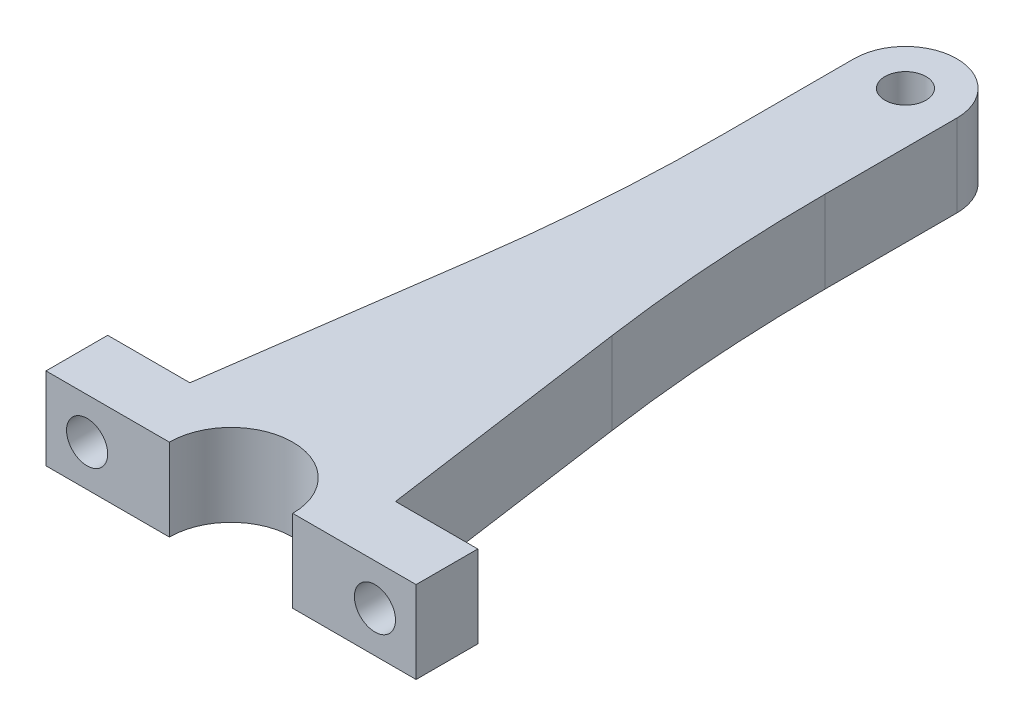
ISO-10303-21;
HEADER;
FILE_DESCRIPTION(('STEP AP214'),'2;1');
FILE_NAME('part.step','',(''),(''),'','','');
FILE_SCHEMA(('AUTOMOTIVE_DESIGN { 1 0 10303 214 1 1 1 1 }'));
ENDSEC;
DATA;
#1=APPLICATION_CONTEXT('core data for automotive mechanical design processes');
#2=APPLICATION_PROTOCOL_DEFINITION('international standard','automotive_design',2000,#1);
#3=PRODUCT_CONTEXT('',#1,'mechanical');
#4=PRODUCT('Part','Part','',(#3));
#5=PRODUCT_RELATED_PRODUCT_CATEGORY('part','',(#4));
#6=PRODUCT_DEFINITION_FORMATION('','',#4);
#7=PRODUCT_DEFINITION_CONTEXT('part definition',#1,'design');
#8=PRODUCT_DEFINITION('design','',#6,#7);
#9=PRODUCT_DEFINITION_SHAPE('','',#8);
#10=(LENGTH_UNIT() NAMED_UNIT(*) SI_UNIT(.MILLI.,.METRE.));
#11=(NAMED_UNIT(*) PLANE_ANGLE_UNIT() SI_UNIT($,.RADIAN.));
#12=(NAMED_UNIT(*) SI_UNIT($,.STERADIAN.) SOLID_ANGLE_UNIT());
#13=UNCERTAINTY_MEASURE_WITH_UNIT(LENGTH_MEASURE(1.E-05),#10,'distance_accuracy_value','');
#14=(GEOMETRIC_REPRESENTATION_CONTEXT(3) GLOBAL_UNCERTAINTY_ASSIGNED_CONTEXT((#13)) GLOBAL_UNIT_ASSIGNED_CONTEXT((#10,
#11,#12)) REPRESENTATION_CONTEXT('',''));
#15=CARTESIAN_POINT('',(0.,0.,0.));
#16=DIRECTION('',(0.,0.,1.));
#17=DIRECTION('',(1.,0.,0.));
#18=AXIS2_PLACEMENT_3D('',#15,#16,#17);
#19=CARTESIAN_POINT('',(0.,20.,-156.5));
#20=DIRECTION('',(0.,-1.,0.));
#21=DIRECTION('',(0.,0.,-1.));
#22=AXIS2_PLACEMENT_3D('',#19,#20,#21);
#23=CYLINDRICAL_SURFACE('',#22,12.5);
#24=CARTESIAN_POINT('',(0.,0.,-156.5));
#25=DIRECTION('',(0.,1.,0.));
#26=DIRECTION('',(0.,0.,1.));
#27=AXIS2_PLACEMENT_3D('',#24,#25,#26);
#28=CIRCLE('',#27,12.5);
#29=CARTESIAN_POINT('',(12.5,0.,-156.5));
#30=VERTEX_POINT('',#29);
#31=CARTESIAN_POINT('',(-12.5,0.,-156.5));
#32=VERTEX_POINT('',#31);
#33=EDGE_CURVE('E173',#30,#32,#28,.T.);
#34=ORIENTED_EDGE('',*,*,#33,.T.);
#35=DIRECTION('',(0.,-1.,0.));
#36=VECTOR('',#35,1.);
#37=CARTESIAN_POINT('',(-12.5,20.,-156.5));
#38=LINE('',#37,#36);
#39=CARTESIAN_POINT('',(-12.5,20.,-156.5));
#40=VERTEX_POINT('',#39);
#41=EDGE_CURVE('E151',#40,#32,#38,.T.);
#42=ORIENTED_EDGE('',*,*,#41,.F.);
#43=CARTESIAN_POINT('',(0.,20.,-156.5));
#44=DIRECTION('',(0.,1.,0.));
#45=DIRECTION('',(0.,0.,1.));
#46=AXIS2_PLACEMENT_3D('',#43,#44,#45);
#47=CIRCLE('',#46,12.5);
#48=CARTESIAN_POINT('',(12.5,20.,-156.5));
#49=VERTEX_POINT('',#48);
#50=EDGE_CURVE('E159',#49,#40,#47,.T.);
#51=ORIENTED_EDGE('',*,*,#50,.F.);
#52=DIRECTION('',(0.,-1.,0.));
#53=VECTOR('',#52,1.);
#54=CARTESIAN_POINT('',(12.5,20.,-156.5));
#55=LINE('',#54,#53);
#56=EDGE_CURVE('E263',#49,#30,#55,.T.);
#57=ORIENTED_EDGE('',*,*,#56,.T.);
#58=EDGE_LOOP('',(#34,#42,#51,#57));
#59=FACE_BOUND('',#58,.T.);
#60=ADVANCED_FACE('F44',(#59),#23,.T.);
#61=CARTESIAN_POINT('',(-12.5,20.,0.));
#62=DIRECTION('',(-1.,0.,0.));
#63=DIRECTION('',(0.,0.,1.));
#64=AXIS2_PLACEMENT_3D('',#61,#62,#63);
#65=PLANE('',#64);
#66=DIRECTION('',(0.,0.,-1.));
#67=VECTOR('',#66,1.);
#68=CARTESIAN_POINT('',(-12.5,0.,0.));
#69=LINE('',#68,#67);
#70=CARTESIAN_POINT('',(-12.5,0.,-124.412846307206));
#71=VERTEX_POINT('',#70);
#72=EDGE_CURVE('E216',#71,#32,#69,.T.);
#73=ORIENTED_EDGE('',*,*,#72,.F.);
#74=DIRECTION('',(0.,-1.,0.));
#75=VECTOR('',#74,1.);
#76=CARTESIAN_POINT('',(-12.5,20.,-124.412846307206));
#77=LINE('',#76,#75);
#78=CARTESIAN_POINT('',(-12.5,20.,-124.412846307206));
#79=VERTEX_POINT('',#78);
#80=EDGE_CURVE('E154',#71,#79,#77,.F.);
#81=ORIENTED_EDGE('',*,*,#80,.T.);
#82=DIRECTION('',(0.,0.,-1.));
#83=VECTOR('',#82,1.);
#84=CARTESIAN_POINT('',(-12.5,20.,0.));
#85=LINE('',#84,#83);
#86=EDGE_CURVE('E146',#79,#40,#85,.T.);
#87=ORIENTED_EDGE('',*,*,#86,.T.);
#88=ORIENTED_EDGE('',*,*,#41,.T.);
#89=EDGE_LOOP('',(#73,#81,#87,#88));
#90=FACE_BOUND('',#89,.T.);
#91=ADVANCED_FACE('F149',(#90),#65,.T.);
#92=CARTESIAN_POINT('',(-25.5494112835427,20.,-3.5907355879438));
#93=DIRECTION('',(-0.99026806874157,0.,-0.139173100960066));
#94=DIRECTION('',(-0.139173100960066,0.,0.99026806874157));
#95=AXIS2_PLACEMENT_3D('',#92,#93,#94);
#96=PLANE('',#95);
#97=DIRECTION('',(0.139173100960066,0.,-0.99026806874157));
#98=VECTOR('',#97,1.);
#99=CARTESIAN_POINT('',(-25.5494112835427,20.,-3.5907355879438));
#100=LINE('',#99,#98);
#101=CARTESIAN_POINT('',(-25.,20.,-7.5));
#102=VERTEX_POINT('',#101);
#103=CARTESIAN_POINT('',(-16.3927725033719,20.,-68.7436059231801));
#104=VERTEX_POINT('',#103);
#105=EDGE_CURVE('E158',#102,#104,#100,.T.);
#106=ORIENTED_EDGE('',*,*,#105,.T.);
#107=DIRECTION('',(0.,-1.,0.));
#108=VECTOR('',#107,1.);
#109=CARTESIAN_POINT('',(-16.3927725033719,0.,-68.7436059231801));
#110=LINE('',#109,#108);
#111=CARTESIAN_POINT('',(-16.3927725033719,0.,-68.7436059231801));
#112=VERTEX_POINT('',#111);
#113=EDGE_CURVE('E175',#104,#112,#110,.T.);
#114=ORIENTED_EDGE('',*,*,#113,.T.);
#115=DIRECTION('',(0.139173100960066,0.,-0.99026806874157));
#116=VECTOR('',#115,1.);
#117=CARTESIAN_POINT('',(-25.5494112835427,0.,-3.5907355879438));
#118=LINE('',#117,#116);
#119=CARTESIAN_POINT('',(-25.,0.,-7.5));
#120=VERTEX_POINT('',#119);
#121=EDGE_CURVE('E218',#120,#112,#118,.T.);
#122=ORIENTED_EDGE('',*,*,#121,.F.);
#123=DIRECTION('',(0.,-1.,0.));
#124=VECTOR('',#123,1.);
#125=CARTESIAN_POINT('',(-25.,20.,-7.5));
#126=LINE('',#125,#124);
#127=EDGE_CURVE('E176',#102,#120,#126,.T.);
#128=ORIENTED_EDGE('',*,*,#127,.F.);
#129=EDGE_LOOP('',(#106,#114,#122,#128));
#130=FACE_BOUND('',#129,.T.);
#131=ADVANCED_FACE('F207',(#130),#96,.T.);
#132=CARTESIAN_POINT('',(0.,20.,-7.5));
#133=DIRECTION('',(0.,0.,-1.));
#134=DIRECTION('',(-1.,0.,0.));
#135=AXIS2_PLACEMENT_3D('',#132,#133,#134);
#136=PLANE('',#135);
#137=CARTESIAN_POINT('',(-35.,10.,-7.5));
#138=DIRECTION('',(0.,0.,-1.));
#139=DIRECTION('',(-1.,0.,0.));
#140=AXIS2_PLACEMENT_3D('',#137,#138,#139);
#141=CIRCLE('',#140,5.);
#142=CARTESIAN_POINT('',(-40.,10.,-7.5));
#143=VERTEX_POINT('',#142);
#144=EDGE_CURVE('E371',#143,#143,#141,.T.);
#145=ORIENTED_EDGE('',*,*,#144,.F.);
#146=EDGE_LOOP('',(#145));
#147=FACE_BOUND('',#146,.T.);
#148=DIRECTION('',(1.,0.,0.));
#149=VECTOR('',#148,1.);
#150=CARTESIAN_POINT('',(0.,0.,-7.5));
#151=LINE('',#150,#149);
#152=CARTESIAN_POINT('',(-45.,0.,-7.5));
#153=VERTEX_POINT('',#152);
#154=EDGE_CURVE('E223',#153,#120,#151,.T.);
#155=ORIENTED_EDGE('',*,*,#154,.F.);
#156=DIRECTION('',(0.,-1.,0.));
#157=VECTOR('',#156,1.);
#158=CARTESIAN_POINT('',(-45.,20.,-7.5));
#159=LINE('',#158,#157);
#160=CARTESIAN_POINT('',(-45.,20.,-7.5));
#161=VERTEX_POINT('',#160);
#162=EDGE_CURVE('E182',#161,#153,#159,.T.);
#163=ORIENTED_EDGE('',*,*,#162,.F.);
#164=DIRECTION('',(1.,0.,0.));
#165=VECTOR('',#164,1.);
#166=CARTESIAN_POINT('',(0.,20.,-7.5));
#167=LINE('',#166,#165);
#168=EDGE_CURVE('E211',#161,#102,#167,.T.);
#169=ORIENTED_EDGE('',*,*,#168,.T.);
#170=ORIENTED_EDGE('',*,*,#127,.T.);
#171=EDGE_LOOP('',(#155,#163,#169,#170));
#172=FACE_BOUND('',#171,.T.);
#173=ADVANCED_FACE('F294',(#147,#172),#136,.T.);
#174=CARTESIAN_POINT('',(-45.,20.,0.));
#175=DIRECTION('',(-1.,0.,0.));
#176=DIRECTION('',(0.,0.,1.));
#177=AXIS2_PLACEMENT_3D('',#174,#175,#176);
#178=PLANE('',#177);
#179=DIRECTION('',(0.,0.,-1.));
#180=VECTOR('',#179,1.);
#181=CARTESIAN_POINT('',(-45.,0.,0.));
#182=LINE('',#181,#180);
#183=CARTESIAN_POINT('',(-45.,0.,7.5));
#184=VERTEX_POINT('',#183);
#185=EDGE_CURVE('E231',#184,#153,#182,.T.);
#186=ORIENTED_EDGE('',*,*,#185,.F.);
#187=DIRECTION('',(0.,-1.,0.));
#188=VECTOR('',#187,1.);
#189=CARTESIAN_POINT('',(-45.,20.,7.5));
#190=LINE('',#189,#188);
#191=CARTESIAN_POINT('',(-45.,20.,7.5));
#192=VERTEX_POINT('',#191);
#193=EDGE_CURVE('E283',#192,#184,#190,.T.);
#194=ORIENTED_EDGE('',*,*,#193,.F.);
#195=DIRECTION('',(0.,0.,-1.));
#196=VECTOR('',#195,1.);
#197=CARTESIAN_POINT('',(-45.,20.,0.));
#198=LINE('',#197,#196);
#199=EDGE_CURVE('E292',#192,#161,#198,.T.);
#200=ORIENTED_EDGE('',*,*,#199,.T.);
#201=ORIENTED_EDGE('',*,*,#162,.T.);
#202=EDGE_LOOP('',(#186,#194,#200,#201));
#203=FACE_BOUND('',#202,.T.);
#204=ADVANCED_FACE('F290',(#203),#178,.T.);
#205=CARTESIAN_POINT('',(0.,20.,7.5));
#206=DIRECTION('',(0.,0.,-1.));
#207=DIRECTION('',(-1.,0.,0.));
#208=AXIS2_PLACEMENT_3D('',#205,#206,#207);
#209=PLANE('',#208);
#210=CARTESIAN_POINT('',(-35.,10.,7.5));
#211=DIRECTION('',(0.,0.,-1.));
#212=DIRECTION('',(-1.,0.,0.));
#213=AXIS2_PLACEMENT_3D('',#210,#211,#212);
#214=CIRCLE('',#213,5.);
#215=CARTESIAN_POINT('',(-40.,10.,7.5));
#216=VERTEX_POINT('',#215);
#217=EDGE_CURVE('E225',#216,#216,#214,.T.);
#218=ORIENTED_EDGE('',*,*,#217,.T.);
#219=EDGE_LOOP('',(#218));
#220=FACE_BOUND('',#219,.T.);
#221=DIRECTION('',(1.,0.,0.));
#222=VECTOR('',#221,1.);
#223=CARTESIAN_POINT('',(0.,0.,7.5));
#224=LINE('',#223,#222);
#225=CARTESIAN_POINT('',(-15.,0.,7.5));
#226=VERTEX_POINT('',#225);
#227=EDGE_CURVE('E235',#184,#226,#224,.T.);
#228=ORIENTED_EDGE('',*,*,#227,.T.);
#229=DIRECTION('',(0.,-1.,0.));
#230=VECTOR('',#229,1.);
#231=CARTESIAN_POINT('',(-15.,20.,7.5));
#232=LINE('',#231,#230);
#233=CARTESIAN_POINT('',(-15.,20.,7.5));
#234=VERTEX_POINT('',#233);
#235=EDGE_CURVE('E280',#234,#226,#232,.T.);
#236=ORIENTED_EDGE('',*,*,#235,.F.);
#237=DIRECTION('',(1.,0.,0.));
#238=VECTOR('',#237,1.);
#239=CARTESIAN_POINT('',(0.,20.,7.5));
#240=LINE('',#239,#238);
#241=EDGE_CURVE('E303',#192,#234,#240,.T.);
#242=ORIENTED_EDGE('',*,*,#241,.F.);
#243=ORIENTED_EDGE('',*,*,#193,.T.);
#244=EDGE_LOOP('',(#228,#236,#242,#243));
#245=FACE_BOUND('',#244,.T.);
#246=ADVANCED_FACE('F300',(#220,#245),#209,.F.);
#247=CARTESIAN_POINT('',(0.,20.,7.5));
#248=DIRECTION('',(0.,-1.,0.));
#249=DIRECTION('',(0.,0.,-1.));
#250=AXIS2_PLACEMENT_3D('',#247,#248,#249);
#251=CYLINDRICAL_SURFACE('',#250,15.);
#252=CARTESIAN_POINT('',(0.,0.,7.5));
#253=DIRECTION('',(0.,1.,0.));
#254=DIRECTION('',(0.,0.,1.));
#255=AXIS2_PLACEMENT_3D('',#252,#253,#254);
#256=CIRCLE('',#255,15.);
#257=CARTESIAN_POINT('',(15.,0.,7.5));
#258=VERTEX_POINT('',#257);
#259=EDGE_CURVE('E239',#258,#226,#256,.T.);
#260=ORIENTED_EDGE('',*,*,#259,.F.);
#261=DIRECTION('',(0.,-1.,0.));
#262=VECTOR('',#261,1.);
#263=CARTESIAN_POINT('',(15.,20.,7.5));
#264=LINE('',#263,#262);
#265=CARTESIAN_POINT('',(15.,20.,7.5));
#266=VERTEX_POINT('',#265);
#267=EDGE_CURVE('E277',#266,#258,#264,.T.);
#268=ORIENTED_EDGE('',*,*,#267,.F.);
#269=CARTESIAN_POINT('',(0.,20.,7.5));
#270=DIRECTION('',(0.,1.,0.));
#271=DIRECTION('',(0.,0.,1.));
#272=AXIS2_PLACEMENT_3D('',#269,#270,#271);
#273=CIRCLE('',#272,15.);
#274=EDGE_CURVE('E306',#266,#234,#273,.T.);
#275=ORIENTED_EDGE('',*,*,#274,.T.);
#276=ORIENTED_EDGE('',*,*,#235,.T.);
#277=EDGE_LOOP('',(#260,#268,#275,#276));
#278=FACE_BOUND('',#277,.T.);
#279=ADVANCED_FACE('F417',(#278),#251,.F.);
#280=CARTESIAN_POINT('',(0.,20.,7.5));
#281=DIRECTION('',(0.,0.,-1.));
#282=DIRECTION('',(-1.,0.,0.));
#283=AXIS2_PLACEMENT_3D('',#280,#281,#282);
#284=PLANE('',#283);
#285=CARTESIAN_POINT('',(35.,9.99999999999999,7.5));
#286=DIRECTION('',(0.,0.,-1.));
#287=DIRECTION('',(1.,0.,0.));
#288=AXIS2_PLACEMENT_3D('',#285,#286,#287);
#289=CIRCLE('',#288,5.);
#290=CARTESIAN_POINT('',(40.,9.99999999999999,7.5));
#291=VERTEX_POINT('',#290);
#292=EDGE_CURVE('E380',#291,#291,#289,.T.);
#293=ORIENTED_EDGE('',*,*,#292,.T.);
#294=EDGE_LOOP('',(#293));
#295=FACE_BOUND('',#294,.T.);
#296=DIRECTION('',(1.,0.,0.));
#297=VECTOR('',#296,1.);
#298=CARTESIAN_POINT('',(0.,0.,7.5));
#299=LINE('',#298,#297);
#300=CARTESIAN_POINT('',(45.,0.,7.5));
#301=VERTEX_POINT('',#300);
#302=EDGE_CURVE('E243',#258,#301,#299,.T.);
#303=ORIENTED_EDGE('',*,*,#302,.T.);
#304=DIRECTION('',(0.,-1.,0.));
#305=VECTOR('',#304,1.);
#306=CARTESIAN_POINT('',(45.,20.,7.5));
#307=LINE('',#306,#305);
#308=CARTESIAN_POINT('',(45.,20.,7.5));
#309=VERTEX_POINT('',#308);
#310=EDGE_CURVE('E273',#309,#301,#307,.T.);
#311=ORIENTED_EDGE('',*,*,#310,.F.);
#312=DIRECTION('',(1.,0.,0.));
#313=VECTOR('',#312,1.);
#314=CARTESIAN_POINT('',(0.,20.,7.5));
#315=LINE('',#314,#313);
#316=EDGE_CURVE('E315',#266,#309,#315,.T.);
#317=ORIENTED_EDGE('',*,*,#316,.F.);
#318=ORIENTED_EDGE('',*,*,#267,.T.);
#319=EDGE_LOOP('',(#303,#311,#317,#318));
#320=FACE_BOUND('',#319,.T.);
#321=ADVANCED_FACE('F387',(#295,#320),#284,.F.);
#322=CARTESIAN_POINT('',(45.,20.,0.));
#323=DIRECTION('',(-1.,0.,0.));
#324=DIRECTION('',(0.,0.,1.));
#325=AXIS2_PLACEMENT_3D('',#322,#323,#324);
#326=PLANE('',#325);
#327=DIRECTION('',(0.,0.,-1.));
#328=VECTOR('',#327,1.);
#329=CARTESIAN_POINT('',(45.,0.,0.));
#330=LINE('',#329,#328);
#331=CARTESIAN_POINT('',(45.,0.,-7.5));
#332=VERTEX_POINT('',#331);
#333=EDGE_CURVE('E246',#301,#332,#330,.T.);
#334=ORIENTED_EDGE('',*,*,#333,.T.);
#335=DIRECTION('',(0.,-1.,0.));
#336=VECTOR('',#335,1.);
#337=CARTESIAN_POINT('',(45.,20.,-7.5));
#338=LINE('',#337,#336);
#339=CARTESIAN_POINT('',(45.,20.,-7.5));
#340=VERTEX_POINT('',#339);
#341=EDGE_CURVE('E270',#340,#332,#338,.T.);
#342=ORIENTED_EDGE('',*,*,#341,.F.);
#343=DIRECTION('',(0.,0.,-1.));
#344=VECTOR('',#343,1.);
#345=CARTESIAN_POINT('',(45.,20.,0.));
#346=LINE('',#345,#344);
#347=EDGE_CURVE('E318',#309,#340,#346,.T.);
#348=ORIENTED_EDGE('',*,*,#347,.F.);
#349=ORIENTED_EDGE('',*,*,#310,.T.);
#350=EDGE_LOOP('',(#334,#342,#348,#349));
#351=FACE_BOUND('',#350,.T.);
#352=ADVANCED_FACE('F396',(#351),#326,.F.);
#353=CARTESIAN_POINT('',(0.,20.,-7.5));
#354=DIRECTION('',(0.,0.,-1.));
#355=DIRECTION('',(-1.,0.,0.));
#356=AXIS2_PLACEMENT_3D('',#353,#354,#355);
#357=PLANE('',#356);
#358=CARTESIAN_POINT('',(35.,9.99999999999999,-7.5));
#359=DIRECTION('',(0.,0.,-1.));
#360=DIRECTION('',(1.,0.,0.));
#361=AXIS2_PLACEMENT_3D('',#358,#359,#360);
#362=CIRCLE('',#361,5.);
#363=CARTESIAN_POINT('',(40.,9.99999999999999,-7.5));
#364=VERTEX_POINT('',#363);
#365=EDGE_CURVE('E374',#364,#364,#362,.T.);
#366=ORIENTED_EDGE('',*,*,#365,.F.);
#367=EDGE_LOOP('',(#366));
#368=FACE_BOUND('',#367,.T.);
#369=DIRECTION('',(1.,0.,0.));
#370=VECTOR('',#369,1.);
#371=CARTESIAN_POINT('',(0.,0.,-7.5));
#372=LINE('',#371,#370);
#373=CARTESIAN_POINT('',(25.,0.,-7.5));
#374=VERTEX_POINT('',#373);
#375=EDGE_CURVE('E250',#374,#332,#372,.T.);
#376=ORIENTED_EDGE('',*,*,#375,.F.);
#377=DIRECTION('',(0.,-1.,0.));
#378=VECTOR('',#377,1.);
#379=CARTESIAN_POINT('',(25.,20.,-7.5));
#380=LINE('',#379,#378);
#381=CARTESIAN_POINT('',(25.,20.,-7.5));
#382=VERTEX_POINT('',#381);
#383=EDGE_CURVE('E266',#382,#374,#380,.T.);
#384=ORIENTED_EDGE('',*,*,#383,.F.);
#385=DIRECTION('',(1.,0.,0.));
#386=VECTOR('',#385,1.);
#387=CARTESIAN_POINT('',(0.,20.,-7.5));
#388=LINE('',#387,#386);
#389=EDGE_CURVE('E321',#382,#340,#388,.T.);
#390=ORIENTED_EDGE('',*,*,#389,.T.);
#391=ORIENTED_EDGE('',*,*,#341,.T.);
#392=EDGE_LOOP('',(#376,#384,#390,#391));
#393=FACE_BOUND('',#392,.T.);
#394=ADVANCED_FACE('F392',(#368,#393),#357,.T.);
#395=CARTESIAN_POINT('',(25.5494112835427,20.,-3.5907355879438));
#396=DIRECTION('',(-0.99026806874157,0.,0.139173100960066));
#397=DIRECTION('',(0.139173100960066,0.,0.99026806874157));
#398=AXIS2_PLACEMENT_3D('',#395,#396,#397);
#399=PLANE('',#398);
#400=DIRECTION('',(-0.139173100960066,0.,-0.99026806874157));
#401=VECTOR('',#400,1.);
#402=CARTESIAN_POINT('',(25.5494112835427,0.,-3.5907355879438));
#403=LINE('',#402,#401);
#404=CARTESIAN_POINT('',(16.3927725033719,0.,-68.7436059231801));
#405=VERTEX_POINT('',#404);
#406=EDGE_CURVE('E254',#374,#405,#403,.T.);
#407=ORIENTED_EDGE('',*,*,#406,.T.);
#408=DIRECTION('',(0.,-1.,0.));
#409=VECTOR('',#408,1.);
#410=CARTESIAN_POINT('',(16.3927725033719,20.,-68.7436059231801));
#411=LINE('',#410,#409);
#412=CARTESIAN_POINT('',(16.3927725033719,20.,-68.7436059231801));
#413=VERTEX_POINT('',#412);
#414=EDGE_CURVE('E60',#405,#413,#411,.F.);
#415=ORIENTED_EDGE('',*,*,#414,.T.);
#416=DIRECTION('',(-0.139173100960066,0.,-0.99026806874157));
#417=VECTOR('',#416,1.);
#418=CARTESIAN_POINT('',(25.5494112835427,20.,-3.5907355879438));
#419=LINE('',#418,#417);
#420=EDGE_CURVE('E325',#382,#413,#419,.T.);
#421=ORIENTED_EDGE('',*,*,#420,.F.);
#422=ORIENTED_EDGE('',*,*,#383,.T.);
#423=EDGE_LOOP('',(#407,#415,#421,#422));
#424=FACE_BOUND('',#423,.T.);
#425=ADVANCED_FACE('F395',(#424),#399,.F.);
#426=CARTESIAN_POINT('',(12.5,20.,0.));
#427=DIRECTION('',(-1.,0.,0.));
#428=DIRECTION('',(0.,0.,1.));
#429=AXIS2_PLACEMENT_3D('',#426,#427,#428);
#430=PLANE('',#429);
#431=DIRECTION('',(0.,0.,-1.));
#432=VECTOR('',#431,1.);
#433=CARTESIAN_POINT('',(12.5,20.,0.));
#434=LINE('',#433,#432);
#435=CARTESIAN_POINT('',(12.5,20.,-124.412846307206));
#436=VERTEX_POINT('',#435);
#437=EDGE_CURVE('E165',#436,#49,#434,.T.);
#438=ORIENTED_EDGE('',*,*,#437,.F.);
#439=DIRECTION('',(0.,-1.,0.));
#440=VECTOR('',#439,1.);
#441=CARTESIAN_POINT('',(12.5,0.,-124.412846307206));
#442=LINE('',#441,#440);
#443=CARTESIAN_POINT('',(12.5,0.,-124.412846307206));
#444=VERTEX_POINT('',#443);
#445=EDGE_CURVE('E188',#436,#444,#442,.T.);
#446=ORIENTED_EDGE('',*,*,#445,.T.);
#447=DIRECTION('',(0.,0.,-1.));
#448=VECTOR('',#447,1.);
#449=CARTESIAN_POINT('',(12.5,0.,0.));
#450=LINE('',#449,#448);
#451=EDGE_CURVE('E257',#444,#30,#450,.T.);
#452=ORIENTED_EDGE('',*,*,#451,.T.);
#453=ORIENTED_EDGE('',*,*,#56,.F.);
#454=EDGE_LOOP('',(#438,#446,#452,#453));
#455=FACE_BOUND('',#454,.T.);
#456=ADVANCED_FACE('F343',(#455),#430,.F.);
#457=CARTESIAN_POINT('',(0.,20.,-156.5));
#458=DIRECTION('',(0.,-1.,0.));
#459=DIRECTION('',(0.,0.,-1.));
#460=AXIS2_PLACEMENT_3D('',#457,#458,#459);
#461=CYLINDRICAL_SURFACE('',#460,5.00000000000001);
#462=CARTESIAN_POINT('',(0.,20.,-156.5));
#463=DIRECTION('',(0.,1.,0.));
#464=DIRECTION('',(0.,0.,1.));
#465=AXIS2_PLACEMENT_3D('',#462,#463,#464);
#466=CIRCLE('',#465,5.00000000000001);
#467=CARTESIAN_POINT('',(0.,20.,-151.5));
#468=VERTEX_POINT('',#467);
#469=EDGE_CURVE('E267',#468,#468,#466,.T.);
#470=ORIENTED_EDGE('',*,*,#469,.T.);
#471=EDGE_LOOP('',(#470));
#472=FACE_BOUND('',#471,.T.);
#473=CARTESIAN_POINT('',(0.,0.,-156.5));
#474=DIRECTION('',(0.,1.,0.));
#475=DIRECTION('',(0.,0.,1.));
#476=AXIS2_PLACEMENT_3D('',#473,#474,#475);
#477=CIRCLE('',#476,5.00000000000001);
#478=CARTESIAN_POINT('',(0.,0.,-151.5));
#479=VERTEX_POINT('',#478);
#480=EDGE_CURVE('E170',#479,#479,#477,.T.);
#481=ORIENTED_EDGE('',*,*,#480,.F.);
#482=EDGE_LOOP('',(#481));
#483=FACE_BOUND('',#482,.T.);
#484=ADVANCED_FACE('F333',(#472,#483),#461,.F.);
#485=CARTESIAN_POINT('',(0.,20.,0.));
#486=DIRECTION('',(0.,1.,0.));
#487=DIRECTION('',(0.,0.,1.));
#488=AXIS2_PLACEMENT_3D('',#485,#486,#487);
#489=PLANE('',#488);
#490=ORIENTED_EDGE('',*,*,#50,.T.);
#491=ORIENTED_EDGE('',*,*,#86,.F.);
#492=CARTESIAN_POINT('',(-412.5,20.,-124.412846307206));
#493=DIRECTION('',(0.,1.,0.));
#494=DIRECTION('',(0.,0.,1.));
#495=AXIS2_PLACEMENT_3D('',#492,#493,#494);
#496=CIRCLE('',#495,400.);
#497=EDGE_CURVE('E197',#79,#104,#496,.F.);
#498=ORIENTED_EDGE('',*,*,#497,.T.);
#499=ORIENTED_EDGE('',*,*,#105,.F.);
#500=ORIENTED_EDGE('',*,*,#168,.F.);
#501=ORIENTED_EDGE('',*,*,#199,.F.);
#502=ORIENTED_EDGE('',*,*,#241,.T.);
#503=ORIENTED_EDGE('',*,*,#274,.F.);
#504=ORIENTED_EDGE('',*,*,#316,.T.);
#505=ORIENTED_EDGE('',*,*,#347,.T.);
#506=ORIENTED_EDGE('',*,*,#389,.F.);
#507=ORIENTED_EDGE('',*,*,#420,.T.);
#508=CARTESIAN_POINT('',(412.5,20.,-124.412846307206));
#509=DIRECTION('',(0.,1.,0.));
#510=DIRECTION('',(0.,0.,1.));
#511=AXIS2_PLACEMENT_3D('',#508,#509,#510);
#512=CIRCLE('',#511,400.);
#513=EDGE_CURVE('E11',#413,#436,#512,.F.);
#514=ORIENTED_EDGE('',*,*,#513,.T.);
#515=ORIENTED_EDGE('',*,*,#437,.T.);
#516=EDGE_LOOP('',(#490,#491,#498,#499,#500,#501,#502,#503,#504,#505,#506,#507,#514,#515));
#517=FACE_BOUND('',#516,.T.);
#518=ORIENTED_EDGE('',*,*,#469,.F.);
#519=EDGE_LOOP('',(#518));
#520=FACE_BOUND('',#519,.T.);
#521=ADVANCED_FACE('F162',(#517,#520),#489,.T.);
#522=CARTESIAN_POINT('',(0.,0.,0.));
#523=DIRECTION('',(0.,1.,0.));
#524=DIRECTION('',(0.,0.,1.));
#525=AXIS2_PLACEMENT_3D('',#522,#523,#524);
#526=PLANE('',#525);
#527=ORIENTED_EDGE('',*,*,#33,.F.);
#528=ORIENTED_EDGE('',*,*,#451,.F.);
#529=CARTESIAN_POINT('',(412.5,0.,-124.412846307206));
#530=DIRECTION('',(0.,1.,0.));
#531=DIRECTION('',(0.,0.,1.));
#532=AXIS2_PLACEMENT_3D('',#529,#530,#531);
#533=CIRCLE('',#532,400.);
#534=EDGE_CURVE('E53',#444,#405,#533,.T.);
#535=ORIENTED_EDGE('',*,*,#534,.T.);
#536=ORIENTED_EDGE('',*,*,#406,.F.);
#537=ORIENTED_EDGE('',*,*,#375,.T.);
#538=ORIENTED_EDGE('',*,*,#333,.F.);
#539=ORIENTED_EDGE('',*,*,#302,.F.);
#540=ORIENTED_EDGE('',*,*,#259,.T.);
#541=ORIENTED_EDGE('',*,*,#227,.F.);
#542=ORIENTED_EDGE('',*,*,#185,.T.);
#543=ORIENTED_EDGE('',*,*,#154,.T.);
#544=ORIENTED_EDGE('',*,*,#121,.T.);
#545=CARTESIAN_POINT('',(-412.5,0.,-124.412846307206));
#546=DIRECTION('',(0.,1.,0.));
#547=DIRECTION('',(0.,0.,1.));
#548=AXIS2_PLACEMENT_3D('',#545,#546,#547);
#549=CIRCLE('',#548,400.);
#550=EDGE_CURVE('E194',#112,#71,#549,.T.);
#551=ORIENTED_EDGE('',*,*,#550,.T.);
#552=ORIENTED_EDGE('',*,*,#72,.T.);
#553=EDGE_LOOP('',(#527,#528,#535,#536,#537,#538,#539,#540,#541,#542,#543,#544,#551,#552));
#554=FACE_BOUND('',#553,.T.);
#555=ORIENTED_EDGE('',*,*,#480,.T.);
#556=EDGE_LOOP('',(#555));
#557=FACE_BOUND('',#556,.T.);
#558=ADVANCED_FACE('F214',(#554,#557),#526,.F.);
#559=CARTESIAN_POINT('',(35.,9.99999999999999,7.5));
#560=DIRECTION('',(0.,0.,-1.));
#561=DIRECTION('',(-1.,0.,0.));
#562=AXIS2_PLACEMENT_3D('',#559,#560,#561);
#563=CYLINDRICAL_SURFACE('',#562,5.);
#564=ORIENTED_EDGE('',*,*,#292,.F.);
#565=EDGE_LOOP('',(#564));
#566=FACE_BOUND('',#565,.T.);
#567=ORIENTED_EDGE('',*,*,#365,.T.);
#568=EDGE_LOOP('',(#567));
#569=FACE_BOUND('',#568,.T.);
#570=ADVANCED_FACE('F341',(#566,#569),#563,.F.);
#571=CARTESIAN_POINT('',(-35.,10.,7.5));
#572=DIRECTION('',(0.,0.,-1.));
#573=DIRECTION('',(-1.,0.,0.));
#574=AXIS2_PLACEMENT_3D('',#571,#572,#573);
#575=CYLINDRICAL_SURFACE('',#574,5.);
#576=ORIENTED_EDGE('',*,*,#217,.F.);
#577=EDGE_LOOP('',(#576));
#578=FACE_BOUND('',#577,.T.);
#579=ORIENTED_EDGE('',*,*,#144,.T.);
#580=EDGE_LOOP('',(#579));
#581=FACE_BOUND('',#580,.T.);
#582=ADVANCED_FACE('F354',(#578,#581),#575,.F.);
#583=CARTESIAN_POINT('',(-412.5,20.,-124.412846307206));
#584=DIRECTION('',(0.,1.,0.));
#585=DIRECTION('',(0.,0.,1.));
#586=AXIS2_PLACEMENT_3D('',#583,#584,#585);
#587=CYLINDRICAL_SURFACE('',#586,400.);
#588=ORIENTED_EDGE('',*,*,#497,.F.);
#589=ORIENTED_EDGE('',*,*,#80,.F.);
#590=ORIENTED_EDGE('',*,*,#550,.F.);
#591=ORIENTED_EDGE('',*,*,#113,.F.);
#592=EDGE_LOOP('',(#588,#589,#590,#591));
#593=FACE_BOUND('',#592,.T.);
#594=ADVANCED_FACE('F213',(#593),#587,.F.);
#595=CARTESIAN_POINT('',(412.5,20.,-124.412846307206));
#596=DIRECTION('',(0.,1.,0.));
#597=DIRECTION('',(0.,0.,1.));
#598=AXIS2_PLACEMENT_3D('',#595,#596,#597);
#599=CYLINDRICAL_SURFACE('',#598,400.);
#600=ORIENTED_EDGE('',*,*,#513,.F.);
#601=ORIENTED_EDGE('',*,*,#414,.F.);
#602=ORIENTED_EDGE('',*,*,#534,.F.);
#603=ORIENTED_EDGE('',*,*,#445,.F.);
#604=EDGE_LOOP('',(#600,#601,#602,#603));
#605=FACE_BOUND('',#604,.T.);
#606=ADVANCED_FACE('F46',(#605),#599,.F.);
#607=CLOSED_SHELL('',(#60,#91,#131,#173,#204,#246,#279,#321,#352,#394,#425,#456,#484,#521,#558,
#570,#582,#594,#606));
#608=MANIFOLD_SOLID_BREP('B2',#607);
#609=ADVANCED_BREP_SHAPE_REPRESENTATION('',(#18,#608),#14);
#610=SHAPE_DEFINITION_REPRESENTATION(#9,#609);
ENDSEC;
END-ISO-10303-21;
